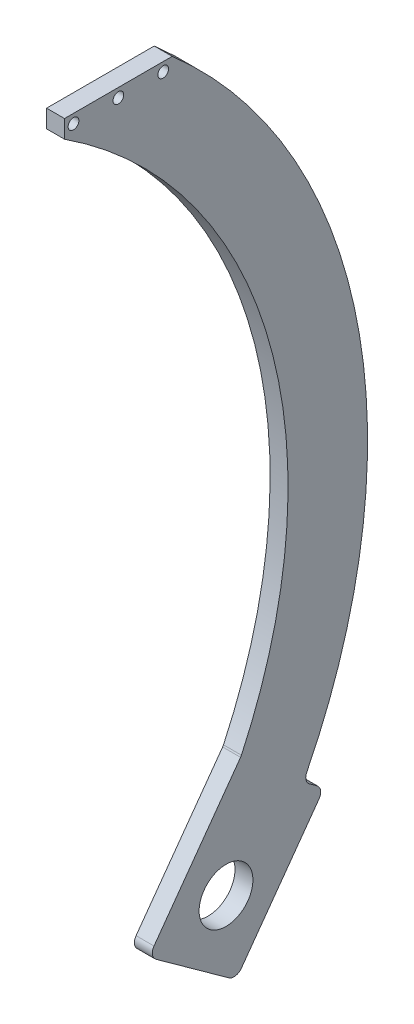
ISO-10303-21;
HEADER;
FILE_DESCRIPTION(('STEP AP214'),'2;1');
FILE_NAME('part.step','',(''),(''),'','','');
FILE_SCHEMA(('AUTOMOTIVE_DESIGN { 1 0 10303 214 1 1 1 1 }'));
ENDSEC;
DATA;
#1=APPLICATION_CONTEXT('core data for automotive mechanical design processes');
#2=APPLICATION_PROTOCOL_DEFINITION('international standard','automotive_design',2000,#1);
#3=PRODUCT_CONTEXT('',#1,'mechanical');
#4=PRODUCT('Part','Part','',(#3));
#5=PRODUCT_RELATED_PRODUCT_CATEGORY('part','',(#4));
#6=PRODUCT_DEFINITION_FORMATION('','',#4);
#7=PRODUCT_DEFINITION_CONTEXT('part definition',#1,'design');
#8=PRODUCT_DEFINITION('design','',#6,#7);
#9=PRODUCT_DEFINITION_SHAPE('','',#8);
#10=(LENGTH_UNIT() NAMED_UNIT(*) SI_UNIT(.MILLI.,.METRE.));
#11=(NAMED_UNIT(*) PLANE_ANGLE_UNIT() SI_UNIT($,.RADIAN.));
#12=(NAMED_UNIT(*) SI_UNIT($,.STERADIAN.) SOLID_ANGLE_UNIT());
#13=UNCERTAINTY_MEASURE_WITH_UNIT(LENGTH_MEASURE(1.E-05),#10,'distance_accuracy_value','');
#14=(GEOMETRIC_REPRESENTATION_CONTEXT(3) GLOBAL_UNCERTAINTY_ASSIGNED_CONTEXT((#13)) GLOBAL_UNIT_ASSIGNED_CONTEXT((#10,
#11,#12)) REPRESENTATION_CONTEXT('',''));
#15=CARTESIAN_POINT('',(0.,0.,0.));
#16=DIRECTION('',(0.,0.,1.));
#17=DIRECTION('',(1.,0.,0.));
#18=AXIS2_PLACEMENT_3D('',#15,#16,#17);
#19=CARTESIAN_POINT('',(6.35,114.3,114.3));
#20=DIRECTION('',(-1.,0.,0.));
#21=DIRECTION('',(0.,0.,1.));
#22=AXIS2_PLACEMENT_3D('',#19,#20,#21);
#23=PLANE('',#22);
#24=DIRECTION('',(0.,0.811253440732448,-0.584694668095892));
#25=VECTOR('',#24,1.);
#26=CARTESIAN_POINT('',(6.35,-27.6231033429099,-41.6733823902444));
#27=LINE('',#26,#25);
#28=CARTESIAN_POINT('',(6.35,-25.0473736685844,-43.5297879614489));
#29=VERTEX_POINT('',#28);
#30=CARTESIAN_POINT('',(6.35,13.073425511438,-71.0045904152782));
#31=VERTEX_POINT('',#30);
#32=EDGE_CURVE('E318',#29,#31,#27,.T.);
#33=ORIENTED_EDGE('',*,*,#32,.T.);
#34=CARTESIAN_POINT('',(6.35,14.9298310826424,-68.4288607409527));
#35=DIRECTION('',(-1.,0.,0.));
#36=DIRECTION('',(0.,0.,1.));
#37=AXIS2_PLACEMENT_3D('',#34,#35,#36);
#38=CIRCLE('',#37,3.175);
#39=CARTESIAN_POINT('',(6.35,17.5055607569679,-70.2852663121571));
#40=VERTEX_POINT('',#39);
#41=EDGE_CURVE('E270',#31,#40,#38,.F.);
#42=ORIENTED_EDGE('',*,*,#41,.T.);
#43=DIRECTION('',(0.,-0.584694668095891,-0.811253440732448));
#44=VECTOR('',#43,1.);
#45=CARTESIAN_POINT('',(6.35,21.0032430671617,-65.4322943875554));
#46=LINE('',#45,#44);
#47=CARTESIAN_POINT('',(6.35,19.4102023335988,-67.6426100392074));
#48=VERTEX_POINT('',#47);
#49=EDGE_CURVE('E311',#48,#40,#46,.T.);
#50=ORIENTED_EDGE('',*,*,#49,.F.);
#51=CARTESIAN_POINT('',(6.35,21.9859320079243,-69.4990156104118));
#52=DIRECTION('',(-1.,0.,0.));
#53=DIRECTION('',(0.,0.,1.));
#54=AXIS2_PLACEMENT_3D('',#51,#52,#53);
#55=CIRCLE('',#54,3.175);
#56=CARTESIAN_POINT('',(6.35,23.4109524042712,-66.6617736626754));
#57=VERTEX_POINT('',#56);
#58=EDGE_CURVE('E12',#48,#57,#55,.T.);
#59=ORIENTED_EDGE('',*,*,#58,.T.);
#60=CARTESIAN_POINT('',(6.35,114.3,114.3));
#61=DIRECTION('',(-1.,0.,0.));
#62=DIRECTION('',(0.,0.,1.));
#63=AXIS2_PLACEMENT_3D('',#60,#61,#62);
#64=CIRCLE('',#63,202.504277732595);
#65=CARTESIAN_POINT('',(6.35,266.7,-19.05));
#66=VERTEX_POINT('',#65);
#67=EDGE_CURVE('E310',#66,#57,#64,.T.);
#68=ORIENTED_EDGE('',*,*,#67,.F.);
#69=DIRECTION('',(0.,0.,-1.));
#70=VECTOR('',#69,1.);
#71=CARTESIAN_POINT('',(6.35,266.7,19.05));
#72=LINE('',#71,#70);
#73=CARTESIAN_POINT('',(6.35,266.7,19.05));
#74=VERTEX_POINT('',#73);
#75=EDGE_CURVE('E212',#74,#66,#72,.T.);
#76=ORIENTED_EDGE('',*,*,#75,.F.);
#77=DIRECTION('',(0.,-1.,0.));
#78=VECTOR('',#77,1.);
#79=CARTESIAN_POINT('',(6.35,266.7,19.05));
#80=LINE('',#79,#78);
#81=CARTESIAN_POINT('',(6.35,260.35,19.05));
#82=VERTEX_POINT('',#81);
#83=EDGE_CURVE('E204',#74,#82,#80,.T.);
#84=ORIENTED_EDGE('',*,*,#83,.T.);
#85=CARTESIAN_POINT('',(6.35,114.3,114.3));
#86=DIRECTION('',(-1.,0.,0.));
#87=DIRECTION('',(0.,0.,1.));
#88=AXIS2_PLACEMENT_3D('',#85,#86,#87);
#89=CIRCLE('',#88,174.365033765374);
#90=CARTESIAN_POINT('',(6.35,40.2506910729311,-43.5602700093456));
#91=VERTEX_POINT('',#90);
#92=EDGE_CURVE('E192',#82,#91,#89,.T.);
#93=ORIENTED_EDGE('',*,*,#92,.T.);
#94=CARTESIAN_POINT('',(6.35,41.5990494608852,-40.6858040315275));
#95=DIRECTION('',(-1.,0.,0.));
#96=DIRECTION('',(0.,0.,1.));
#97=AXIS2_PLACEMENT_3D('',#94,#95,#96);
#98=CIRCLE('',#97,3.175);
#99=CARTESIAN_POINT('',(6.35,39.7426438896807,-43.2615337058531));
#100=VERTEX_POINT('',#99);
#101=EDGE_CURVE('E282',#91,#100,#98,.T.);
#102=ORIENTED_EDGE('',*,*,#101,.T.);
#103=DIRECTION('',(0.,0.811253440732449,-0.58469466809589));
#104=VECTOR('',#103,1.);
#105=CARTESIAN_POINT('',(6.35,37.9260220402172,-41.9522398945765));
#106=LINE('',#105,#104);
#107=CARTESIAN_POINT('',(6.35,-2.77050681413097,-12.6210318695426));
#108=VERTEX_POINT('',#107);
#109=EDGE_CURVE('E203',#108,#100,#106,.T.);
#110=ORIENTED_EDGE('',*,*,#109,.F.);
#111=CARTESIAN_POINT('',(6.35,-4.62691238533537,-15.1967615438681));
#112=DIRECTION('',(-1.,0.,0.));
#113=DIRECTION('',(0.,0.,1.));
#114=AXIS2_PLACEMENT_3D('',#111,#112,#113);
#115=CIRCLE('',#114,3.175);
#116=CARTESIAN_POINT('',(6.35,-7.20264205966089,-13.3403559726636));
#117=VERTEX_POINT('',#116);
#118=EDGE_CURVE('E97',#108,#117,#115,.F.);
#119=ORIENTED_EDGE('',*,*,#118,.T.);
#120=DIRECTION('',(0.,-0.584694668095892,-0.811253440732448));
#121=VECTOR('',#120,1.);
#122=CARTESIAN_POINT('',(6.35,-5.34623648845644,-10.7646262983381));
#123=LINE('',#122,#121);
#124=CARTESIAN_POINT('',(6.35,-25.7666977717055,-39.0976527159189));
#125=VERTEX_POINT('',#124);
#126=EDGE_CURVE('E412',#117,#125,#123,.T.);
#127=ORIENTED_EDGE('',*,*,#126,.T.);
#128=CARTESIAN_POINT('',(6.35,-23.19096809738,-40.9540582871233));
#129=DIRECTION('',(-1.,0.,0.));
#130=DIRECTION('',(0.,0.,1.));
#131=AXIS2_PLACEMENT_3D('',#128,#129,#130);
#132=CIRCLE('',#131,3.175);
#133=EDGE_CURVE('E267',#125,#29,#132,.F.);
#134=ORIENTED_EDGE('',*,*,#133,.T.);
#135=EDGE_LOOP('',(#33,#42,#50,#59,#68,#76,#84,#93,#102,#110,#119,#127,#134));
#136=FACE_BOUND('',#135,.T.);
#137=CARTESIAN_POINT('',(6.35,0.,-38.1));
#138=DIRECTION('',(1.,0.,0.));
#139=DIRECTION('',(0.,0.,-1.));
#140=AXIS2_PLACEMENT_3D('',#137,#138,#139);
#141=CIRCLE('',#140,9.525);
#142=CARTESIAN_POINT('',(6.35,0.,-47.625));
#143=VERTEX_POINT('',#142);
#144=EDGE_CURVE('E325',#143,#143,#141,.T.);
#145=ORIENTED_EDGE('',*,*,#144,.F.);
#146=EDGE_LOOP('',(#145));
#147=FACE_BOUND('',#146,.T.);
#148=CARTESIAN_POINT('',(6.35,263.525,0.));
#149=DIRECTION('',(1.,0.,0.));
#150=DIRECTION('',(0.,0.,-1.));
#151=AXIS2_PLACEMENT_3D('',#148,#149,#150);
#152=CIRCLE('',#151,1.89865);
#153=CARTESIAN_POINT('',(6.35,263.525,-1.89865000000001));
#154=VERTEX_POINT('',#153);
#155=EDGE_CURVE('E396',#154,#154,#152,.T.);
#156=ORIENTED_EDGE('',*,*,#155,.F.);
#157=EDGE_LOOP('',(#156));
#158=FACE_BOUND('',#157,.T.);
#159=CARTESIAN_POINT('',(6.35,263.525,-15.875));
#160=DIRECTION('',(1.,0.,0.));
#161=DIRECTION('',(0.,0.,-1.));
#162=AXIS2_PLACEMENT_3D('',#159,#160,#161);
#163=CIRCLE('',#162,1.89865);
#164=CARTESIAN_POINT('',(6.35,263.525,-17.77365));
#165=VERTEX_POINT('',#164);
#166=EDGE_CURVE('E383',#165,#165,#163,.T.);
#167=ORIENTED_EDGE('',*,*,#166,.F.);
#168=EDGE_LOOP('',(#167));
#169=FACE_BOUND('',#168,.T.);
#170=CARTESIAN_POINT('',(6.35,263.525,15.875));
#171=DIRECTION('',(1.,0.,0.));
#172=DIRECTION('',(0.,0.,-1.));
#173=AXIS2_PLACEMENT_3D('',#170,#171,#172);
#174=CIRCLE('',#173,1.89865);
#175=CARTESIAN_POINT('',(6.35,263.525,13.97635));
#176=VERTEX_POINT('',#175);
#177=EDGE_CURVE('E378',#176,#176,#174,.T.);
#178=ORIENTED_EDGE('',*,*,#177,.F.);
#179=EDGE_LOOP('',(#178));
#180=FACE_BOUND('',#179,.T.);
#181=ADVANCED_FACE('F70',(#136,#147,#158,#169,#180),#23,.F.);
#182=CARTESIAN_POINT('',(0.,114.3,114.3));
#183=DIRECTION('',(-1.,0.,0.));
#184=DIRECTION('',(0.,0.,1.));
#185=AXIS2_PLACEMENT_3D('',#182,#183,#184);
#186=PLANE('',#185);
#187=CARTESIAN_POINT('',(0.,263.525,15.875));
#188=DIRECTION('',(-1.,0.,0.));
#189=DIRECTION('',(0.,0.,1.));
#190=AXIS2_PLACEMENT_3D('',#187,#188,#189);
#191=CIRCLE('',#190,1.89865);
#192=CARTESIAN_POINT('',(0.,263.525,17.77365));
#193=VERTEX_POINT('',#192);
#194=EDGE_CURVE('E381',#193,#193,#191,.T.);
#195=ORIENTED_EDGE('',*,*,#194,.F.);
#196=EDGE_LOOP('',(#195));
#197=FACE_BOUND('',#196,.T.);
#198=CARTESIAN_POINT('',(0.,263.525,-15.875));
#199=DIRECTION('',(-1.,0.,0.));
#200=DIRECTION('',(0.,0.,1.));
#201=AXIS2_PLACEMENT_3D('',#198,#199,#200);
#202=CIRCLE('',#201,1.89865);
#203=CARTESIAN_POINT('',(0.,263.525,-13.97635));
#204=VERTEX_POINT('',#203);
#205=EDGE_CURVE('E389',#204,#204,#202,.T.);
#206=ORIENTED_EDGE('',*,*,#205,.F.);
#207=EDGE_LOOP('',(#206));
#208=FACE_BOUND('',#207,.T.);
#209=CARTESIAN_POINT('',(0.,263.525,0.));
#210=DIRECTION('',(-1.,0.,0.));
#211=DIRECTION('',(0.,0.,1.));
#212=AXIS2_PLACEMENT_3D('',#209,#210,#211);
#213=CIRCLE('',#212,1.89865);
#214=CARTESIAN_POINT('',(0.,263.525,1.89865));
#215=VERTEX_POINT('',#214);
#216=EDGE_CURVE('E399',#215,#215,#213,.T.);
#217=ORIENTED_EDGE('',*,*,#216,.F.);
#218=EDGE_LOOP('',(#217));
#219=FACE_BOUND('',#218,.T.);
#220=DIRECTION('',(0.,-0.584694668095891,-0.811253440732448));
#221=VECTOR('',#220,1.);
#222=CARTESIAN_POINT('',(0.,21.0032430671617,-65.4322943875554));
#223=LINE('',#222,#221);
#224=CARTESIAN_POINT('',(0.,19.4102023335988,-67.6426100392074));
#225=VERTEX_POINT('',#224);
#226=CARTESIAN_POINT('',(0.,17.5055607569679,-70.2852663121571));
#227=VERTEX_POINT('',#226);
#228=EDGE_CURVE('E292',#225,#227,#223,.T.);
#229=ORIENTED_EDGE('',*,*,#228,.T.);
#230=CARTESIAN_POINT('',(0.,14.9298310826424,-68.4288607409527));
#231=DIRECTION('',(-1.,0.,0.));
#232=DIRECTION('',(0.,0.,1.));
#233=AXIS2_PLACEMENT_3D('',#230,#231,#232);
#234=CIRCLE('',#233,3.175);
#235=CARTESIAN_POINT('',(0.,13.073425511438,-71.0045904152782));
#236=VERTEX_POINT('',#235);
#237=EDGE_CURVE('E255',#227,#236,#234,.T.);
#238=ORIENTED_EDGE('',*,*,#237,.T.);
#239=DIRECTION('',(0.,0.811253440732448,-0.584694668095892));
#240=VECTOR('',#239,1.);
#241=CARTESIAN_POINT('',(0.,-27.6231033429099,-41.6733823902444));
#242=LINE('',#241,#240);
#243=CARTESIAN_POINT('',(0.,-25.0473736685844,-43.5297879614489));
#244=VERTEX_POINT('',#243);
#245=EDGE_CURVE('E305',#244,#236,#242,.T.);
#246=ORIENTED_EDGE('',*,*,#245,.F.);
#247=CARTESIAN_POINT('',(0.,-23.19096809738,-40.9540582871233));
#248=DIRECTION('',(-1.,0.,0.));
#249=DIRECTION('',(0.,0.,1.));
#250=AXIS2_PLACEMENT_3D('',#247,#248,#249);
#251=CIRCLE('',#250,3.175);
#252=CARTESIAN_POINT('',(0.,-25.7666977717055,-39.0976527159189));
#253=VERTEX_POINT('',#252);
#254=EDGE_CURVE('E252',#244,#253,#251,.T.);
#255=ORIENTED_EDGE('',*,*,#254,.T.);
#256=DIRECTION('',(0.,-0.584694668095892,-0.811253440732448));
#257=VECTOR('',#256,1.);
#258=CARTESIAN_POINT('',(0.,-5.34623648845644,-10.7646262983381));
#259=LINE('',#258,#257);
#260=CARTESIAN_POINT('',(0.,-7.20264205966089,-13.3403559726636));
#261=VERTEX_POINT('',#260);
#262=EDGE_CURVE('E332',#261,#253,#259,.T.);
#263=ORIENTED_EDGE('',*,*,#262,.F.);
#264=CARTESIAN_POINT('',(0.,-4.62691238533537,-15.1967615438681));
#265=DIRECTION('',(-1.,0.,0.));
#266=DIRECTION('',(0.,0.,1.));
#267=AXIS2_PLACEMENT_3D('',#264,#265,#266);
#268=CIRCLE('',#267,3.175);
#269=CARTESIAN_POINT('',(0.,-2.77050681413092,-12.6210318695426));
#270=VERTEX_POINT('',#269);
#271=EDGE_CURVE('E249',#261,#270,#268,.T.);
#272=ORIENTED_EDGE('',*,*,#271,.T.);
#273=DIRECTION('',(0.,0.811253440732448,-0.584694668095891));
#274=VECTOR('',#273,1.);
#275=CARTESIAN_POINT('',(0.,-5.34623648845644,-10.7646262983381));
#276=LINE('',#275,#274);
#277=CARTESIAN_POINT('',(0.,39.7426438896807,-43.261533705853));
#278=VERTEX_POINT('',#277);
#279=EDGE_CURVE('E328',#270,#278,#276,.T.);
#280=ORIENTED_EDGE('',*,*,#279,.T.);
#281=CARTESIAN_POINT('',(0.,41.5990494608852,-40.6858040315275));
#282=DIRECTION('',(-1.,0.,0.));
#283=DIRECTION('',(0.,0.,1.));
#284=AXIS2_PLACEMENT_3D('',#281,#282,#283);
#285=CIRCLE('',#284,3.175);
#286=CARTESIAN_POINT('',(0.,40.2506910729311,-43.5602700093456));
#287=VERTEX_POINT('',#286);
#288=EDGE_CURVE('E279',#278,#287,#285,.F.);
#289=ORIENTED_EDGE('',*,*,#288,.T.);
#290=CARTESIAN_POINT('',(0.,114.3,114.3));
#291=DIRECTION('',(-1.,0.,0.));
#292=DIRECTION('',(0.,0.,1.));
#293=AXIS2_PLACEMENT_3D('',#290,#291,#292);
#294=CIRCLE('',#293,174.365033765374);
#295=CARTESIAN_POINT('',(0.,260.35,19.05));
#296=VERTEX_POINT('',#295);
#297=EDGE_CURVE('E324',#296,#287,#294,.T.);
#298=ORIENTED_EDGE('',*,*,#297,.F.);
#299=DIRECTION('',(0.,-1.,0.));
#300=VECTOR('',#299,1.);
#301=CARTESIAN_POINT('',(0.,266.7,19.05));
#302=LINE('',#301,#300);
#303=CARTESIAN_POINT('',(0.,266.7,19.05));
#304=VERTEX_POINT('',#303);
#305=EDGE_CURVE('E219',#304,#296,#302,.T.);
#306=ORIENTED_EDGE('',*,*,#305,.F.);
#307=DIRECTION('',(0.,0.,-1.));
#308=VECTOR('',#307,1.);
#309=CARTESIAN_POINT('',(0.,266.7,19.05));
#310=LINE('',#309,#308);
#311=CARTESIAN_POINT('',(0.,266.7,-19.05));
#312=VERTEX_POINT('',#311);
#313=EDGE_CURVE('E215',#304,#312,#310,.T.);
#314=ORIENTED_EDGE('',*,*,#313,.T.);
#315=CARTESIAN_POINT('',(0.,114.3,114.3));
#316=DIRECTION('',(-1.,0.,0.));
#317=DIRECTION('',(0.,0.,1.));
#318=AXIS2_PLACEMENT_3D('',#315,#316,#317);
#319=CIRCLE('',#318,202.504277732595);
#320=CARTESIAN_POINT('',(0.,23.4109524042712,-66.6617736626754));
#321=VERTEX_POINT('',#320);
#322=EDGE_CURVE('E295',#312,#321,#319,.T.);
#323=ORIENTED_EDGE('',*,*,#322,.T.);
#324=CARTESIAN_POINT('',(0.,21.9859320079243,-69.4990156104118));
#325=DIRECTION('',(-1.,0.,0.));
#326=DIRECTION('',(0.,0.,1.));
#327=AXIS2_PLACEMENT_3D('',#324,#325,#326);
#328=CIRCLE('',#327,3.175);
#329=EDGE_CURVE('E79',#321,#225,#328,.F.);
#330=ORIENTED_EDGE('',*,*,#329,.T.);
#331=EDGE_LOOP('',(#229,#238,#246,#255,#263,#272,#280,#289,#298,#306,#314,#323,#330));
#332=FACE_BOUND('',#331,.T.);
#333=CARTESIAN_POINT('',(0.,0.,-38.1));
#334=DIRECTION('',(1.,0.,0.));
#335=DIRECTION('',(0.,0.,-1.));
#336=AXIS2_PLACEMENT_3D('',#333,#334,#335);
#337=CIRCLE('',#336,9.525);
#338=CARTESIAN_POINT('',(0.,0.,-47.625));
#339=VERTEX_POINT('',#338);
#340=EDGE_CURVE('E402',#339,#339,#337,.T.);
#341=ORIENTED_EDGE('',*,*,#340,.T.);
#342=EDGE_LOOP('',(#341));
#343=FACE_BOUND('',#342,.T.);
#344=ADVANCED_FACE('F290',(#197,#208,#219,#332,#343),#186,.T.);
#345=CARTESIAN_POINT('',(6.35,266.7,19.05));
#346=DIRECTION('',(0.,0.,-1.));
#347=DIRECTION('',(0.,1.,0.));
#348=AXIS2_PLACEMENT_3D('',#345,#346,#347);
#349=PLANE('',#348);
#350=ORIENTED_EDGE('',*,*,#305,.T.);
#351=DIRECTION('',(-1.,0.,0.));
#352=VECTOR('',#351,1.);
#353=CARTESIAN_POINT('',(6.35,260.35,19.05));
#354=LINE('',#353,#352);
#355=EDGE_CURVE('E197',#82,#296,#354,.T.);
#356=ORIENTED_EDGE('',*,*,#355,.F.);
#357=ORIENTED_EDGE('',*,*,#83,.F.);
#358=DIRECTION('',(-1.,0.,0.));
#359=VECTOR('',#358,1.);
#360=CARTESIAN_POINT('',(6.35,266.7,19.05));
#361=LINE('',#360,#359);
#362=EDGE_CURVE('E229',#74,#304,#361,.T.);
#363=ORIENTED_EDGE('',*,*,#362,.T.);
#364=EDGE_LOOP('',(#350,#356,#357,#363));
#365=FACE_BOUND('',#364,.T.);
#366=ADVANCED_FACE('F217',(#365),#349,.F.);
#367=CARTESIAN_POINT('',(6.35,114.3,114.3));
#368=DIRECTION('',(-1.,0.,0.));
#369=DIRECTION('',(0.,0.,1.));
#370=AXIS2_PLACEMENT_3D('',#367,#368,#369);
#371=CYLINDRICAL_SURFACE('',#370,174.365033765374);
#372=ORIENTED_EDGE('',*,*,#297,.T.);
#373=DIRECTION('',(-1.,0.,0.));
#374=VECTOR('',#373,1.);
#375=CARTESIAN_POINT('',(6.35,40.2506910729311,-43.5602700093456));
#376=LINE('',#375,#374);
#377=EDGE_CURVE('E200',#287,#91,#376,.F.);
#378=ORIENTED_EDGE('',*,*,#377,.T.);
#379=ORIENTED_EDGE('',*,*,#92,.F.);
#380=ORIENTED_EDGE('',*,*,#355,.T.);
#381=EDGE_LOOP('',(#372,#378,#379,#380));
#382=FACE_BOUND('',#381,.T.);
#383=ADVANCED_FACE('F195',(#382),#371,.F.);
#384=CARTESIAN_POINT('',(6.35,-5.34623648845644,-10.7646262983381));
#385=DIRECTION('',(0.,0.584694668095891,0.811253440732448));
#386=DIRECTION('',(0.,-0.811253440732448,0.584694668095891));
#387=AXIS2_PLACEMENT_3D('',#384,#385,#386);
#388=PLANE('',#387);
#389=ORIENTED_EDGE('',*,*,#109,.T.);
#390=DIRECTION('',(-1.,0.,0.));
#391=VECTOR('',#390,1.);
#392=CARTESIAN_POINT('',(6.35,39.7426438896807,-43.2615337058531));
#393=LINE('',#392,#391);
#394=EDGE_CURVE('E226',#100,#278,#393,.T.);
#395=ORIENTED_EDGE('',*,*,#394,.T.);
#396=ORIENTED_EDGE('',*,*,#279,.F.);
#397=DIRECTION('',(-1.,0.,0.));
#398=VECTOR('',#397,1.);
#399=CARTESIAN_POINT('',(6.35,-2.77050681413092,-12.6210318695426));
#400=LINE('',#399,#398);
#401=EDGE_CURVE('E221',#270,#108,#400,.F.);
#402=ORIENTED_EDGE('',*,*,#401,.T.);
#403=EDGE_LOOP('',(#389,#395,#396,#402));
#404=FACE_BOUND('',#403,.T.);
#405=ADVANCED_FACE('F434',(#404),#388,.T.);
#406=CARTESIAN_POINT('',(6.35,-5.34623648845644,-10.7646262983381));
#407=DIRECTION('',(0.,0.811253440732448,-0.584694668095892));
#408=DIRECTION('',(0.,0.584694668095892,0.811253440732448));
#409=AXIS2_PLACEMENT_3D('',#406,#407,#408);
#410=PLANE('',#409);
#411=ORIENTED_EDGE('',*,*,#262,.T.);
#412=DIRECTION('',(-1.,0.,0.));
#413=VECTOR('',#412,1.);
#414=CARTESIAN_POINT('',(6.35,-25.7666977717055,-39.0976527159189));
#415=LINE('',#414,#413);
#416=EDGE_CURVE('E89',#253,#125,#415,.F.);
#417=ORIENTED_EDGE('',*,*,#416,.T.);
#418=ORIENTED_EDGE('',*,*,#126,.F.);
#419=DIRECTION('',(-1.,0.,0.));
#420=VECTOR('',#419,1.);
#421=CARTESIAN_POINT('',(0.,-7.20264205966089,-13.3403559726636));
#422=LINE('',#421,#420);
#423=EDGE_CURVE('E273',#117,#261,#422,.T.);
#424=ORIENTED_EDGE('',*,*,#423,.T.);
#425=EDGE_LOOP('',(#411,#417,#418,#424));
#426=FACE_BOUND('',#425,.T.);
#427=ADVANCED_FACE('F428',(#426),#410,.F.);
#428=CARTESIAN_POINT('',(6.35,-27.6231033429099,-41.6733823902444));
#429=DIRECTION('',(0.,0.584694668095892,0.811253440732448));
#430=DIRECTION('',(0.,-0.811253440732448,0.584694668095892));
#431=AXIS2_PLACEMENT_3D('',#428,#429,#430);
#432=PLANE('',#431);
#433=ORIENTED_EDGE('',*,*,#245,.T.);
#434=DIRECTION('',(-1.,0.,0.));
#435=VECTOR('',#434,1.);
#436=CARTESIAN_POINT('',(6.35,13.073425511438,-71.0045904152782));
#437=LINE('',#436,#435);
#438=EDGE_CURVE('E262',#236,#31,#437,.F.);
#439=ORIENTED_EDGE('',*,*,#438,.T.);
#440=ORIENTED_EDGE('',*,*,#32,.F.);
#441=DIRECTION('',(-1.,0.,0.));
#442=VECTOR('',#441,1.);
#443=CARTESIAN_POINT('',(6.35,-25.0473736685844,-43.5297879614489));
#444=LINE('',#443,#442);
#445=EDGE_CURVE('E258',#29,#244,#444,.T.);
#446=ORIENTED_EDGE('',*,*,#445,.T.);
#447=EDGE_LOOP('',(#433,#439,#440,#446));
#448=FACE_BOUND('',#447,.T.);
#449=ADVANCED_FACE('F424',(#448),#432,.F.);
#450=CARTESIAN_POINT('',(6.35,21.0032430671617,-65.4322943875554));
#451=DIRECTION('',(0.,0.811253440732448,-0.584694668095891));
#452=DIRECTION('',(0.,0.584694668095891,0.811253440732448));
#453=AXIS2_PLACEMENT_3D('',#450,#451,#452);
#454=PLANE('',#453);
#455=ORIENTED_EDGE('',*,*,#228,.F.);
#456=DIRECTION('',(1.,0.,0.));
#457=VECTOR('',#456,1.);
#458=CARTESIAN_POINT('',(6.35,19.4102023335988,-67.6426100392074));
#459=LINE('',#458,#457);
#460=EDGE_CURVE('E246',#225,#48,#459,.T.);
#461=ORIENTED_EDGE('',*,*,#460,.T.);
#462=ORIENTED_EDGE('',*,*,#49,.T.);
#463=DIRECTION('',(-1.,0.,0.));
#464=VECTOR('',#463,1.);
#465=CARTESIAN_POINT('',(0.,17.5055607569679,-70.2852663121571));
#466=LINE('',#465,#464);
#467=EDGE_CURVE('E242',#40,#227,#466,.T.);
#468=ORIENTED_EDGE('',*,*,#467,.T.);
#469=EDGE_LOOP('',(#455,#461,#462,#468));
#470=FACE_BOUND('',#469,.T.);
#471=ADVANCED_FACE('F300',(#470),#454,.T.);
#472=CARTESIAN_POINT('',(6.35,114.3,114.3));
#473=DIRECTION('',(-1.,0.,0.));
#474=DIRECTION('',(0.,0.,1.));
#475=AXIS2_PLACEMENT_3D('',#472,#473,#474);
#476=CYLINDRICAL_SURFACE('',#475,202.504277732595);
#477=ORIENTED_EDGE('',*,*,#67,.T.);
#478=DIRECTION('',(-1.,0.,0.));
#479=VECTOR('',#478,1.);
#480=CARTESIAN_POINT('',(6.35,23.4109524042712,-66.6617736626754));
#481=LINE('',#480,#479);
#482=EDGE_CURVE('E238',#57,#321,#481,.T.);
#483=ORIENTED_EDGE('',*,*,#482,.T.);
#484=ORIENTED_EDGE('',*,*,#322,.F.);
#485=DIRECTION('',(-1.,0.,0.));
#486=VECTOR('',#485,1.);
#487=CARTESIAN_POINT('',(6.35,266.7,-19.05));
#488=LINE('',#487,#486);
#489=EDGE_CURVE('E222',#66,#312,#488,.T.);
#490=ORIENTED_EDGE('',*,*,#489,.F.);
#491=EDGE_LOOP('',(#477,#483,#484,#490));
#492=FACE_BOUND('',#491,.T.);
#493=ADVANCED_FACE('F313',(#492),#476,.T.);
#494=CARTESIAN_POINT('',(6.35,266.7,19.05));
#495=DIRECTION('',(0.,1.,0.));
#496=DIRECTION('',(0.,0.,1.));
#497=AXIS2_PLACEMENT_3D('',#494,#495,#496);
#498=PLANE('',#497);
#499=ORIENTED_EDGE('',*,*,#313,.F.);
#500=ORIENTED_EDGE('',*,*,#362,.F.);
#501=ORIENTED_EDGE('',*,*,#75,.T.);
#502=ORIENTED_EDGE('',*,*,#489,.T.);
#503=EDGE_LOOP('',(#499,#500,#501,#502));
#504=FACE_BOUND('',#503,.T.);
#505=ADVANCED_FACE('F342',(#504),#498,.T.);
#506=CARTESIAN_POINT('',(6.35,0.,-38.1));
#507=DIRECTION('',(-1.,0.,0.));
#508=DIRECTION('',(0.,0.,1.));
#509=AXIS2_PLACEMENT_3D('',#506,#507,#508);
#510=CYLINDRICAL_SURFACE('',#509,9.525);
#511=ORIENTED_EDGE('',*,*,#144,.T.);
#512=EDGE_LOOP('',(#511));
#513=FACE_BOUND('',#512,.T.);
#514=ORIENTED_EDGE('',*,*,#340,.F.);
#515=EDGE_LOOP('',(#514));
#516=FACE_BOUND('',#515,.T.);
#517=ADVANCED_FACE('F344',(#513,#516),#510,.F.);
#518=CARTESIAN_POINT('',(6.35,41.5990494608852,-40.6858040315275));
#519=DIRECTION('',(-1.,0.,0.));
#520=DIRECTION('',(0.,0.,1.));
#521=AXIS2_PLACEMENT_3D('',#518,#519,#520);
#522=CYLINDRICAL_SURFACE('',#521,3.175);
#523=ORIENTED_EDGE('',*,*,#101,.F.);
#524=ORIENTED_EDGE('',*,*,#377,.F.);
#525=ORIENTED_EDGE('',*,*,#288,.F.);
#526=ORIENTED_EDGE('',*,*,#394,.F.);
#527=EDGE_LOOP('',(#523,#524,#525,#526));
#528=FACE_BOUND('',#527,.T.);
#529=ADVANCED_FACE('F350',(#528),#522,.F.);
#530=CARTESIAN_POINT('',(6.35,21.9859320079243,-69.4990156104118));
#531=DIRECTION('',(-1.,0.,0.));
#532=DIRECTION('',(0.,0.,1.));
#533=AXIS2_PLACEMENT_3D('',#530,#531,#532);
#534=CYLINDRICAL_SURFACE('',#533,3.175);
#535=ORIENTED_EDGE('',*,*,#58,.F.);
#536=ORIENTED_EDGE('',*,*,#460,.F.);
#537=ORIENTED_EDGE('',*,*,#329,.F.);
#538=ORIENTED_EDGE('',*,*,#482,.F.);
#539=EDGE_LOOP('',(#535,#536,#537,#538));
#540=FACE_BOUND('',#539,.T.);
#541=ADVANCED_FACE('F308',(#540),#534,.F.);
#542=CARTESIAN_POINT('',(6.35,14.9298310826424,-68.4288607409527));
#543=DIRECTION('',(1.,0.,0.));
#544=DIRECTION('',(0.,0.,-1.));
#545=AXIS2_PLACEMENT_3D('',#542,#543,#544);
#546=CYLINDRICAL_SURFACE('',#545,3.175);
#547=ORIENTED_EDGE('',*,*,#41,.F.);
#548=ORIENTED_EDGE('',*,*,#438,.F.);
#549=ORIENTED_EDGE('',*,*,#237,.F.);
#550=ORIENTED_EDGE('',*,*,#467,.F.);
#551=EDGE_LOOP('',(#547,#548,#549,#550));
#552=FACE_BOUND('',#551,.T.);
#553=ADVANCED_FACE('F422',(#552),#546,.T.);
#554=CARTESIAN_POINT('',(6.35,-23.19096809738,-40.9540582871233));
#555=DIRECTION('',(-1.,0.,0.));
#556=DIRECTION('',(0.,0.,1.));
#557=AXIS2_PLACEMENT_3D('',#554,#555,#556);
#558=CYLINDRICAL_SURFACE('',#557,3.175);
#559=ORIENTED_EDGE('',*,*,#133,.F.);
#560=ORIENTED_EDGE('',*,*,#416,.F.);
#561=ORIENTED_EDGE('',*,*,#254,.F.);
#562=ORIENTED_EDGE('',*,*,#445,.F.);
#563=EDGE_LOOP('',(#559,#560,#561,#562));
#564=FACE_BOUND('',#563,.T.);
#565=ADVANCED_FACE('F426',(#564),#558,.T.);
#566=CARTESIAN_POINT('',(6.35,-4.62691238533537,-15.1967615438681));
#567=DIRECTION('',(1.,0.,0.));
#568=DIRECTION('',(0.,0.,-1.));
#569=AXIS2_PLACEMENT_3D('',#566,#567,#568);
#570=CYLINDRICAL_SURFACE('',#569,3.175);
#571=ORIENTED_EDGE('',*,*,#118,.F.);
#572=ORIENTED_EDGE('',*,*,#401,.F.);
#573=ORIENTED_EDGE('',*,*,#271,.F.);
#574=ORIENTED_EDGE('',*,*,#423,.F.);
#575=EDGE_LOOP('',(#571,#572,#573,#574));
#576=FACE_BOUND('',#575,.T.);
#577=ADVANCED_FACE('F72',(#576),#570,.T.);
#578=CARTESIAN_POINT('',(6.35,263.525,0.));
#579=DIRECTION('',(1.,0.,0.));
#580=DIRECTION('',(0.,0.,-1.));
#581=AXIS2_PLACEMENT_3D('',#578,#579,#580);
#582=CYLINDRICAL_SURFACE('',#581,1.89865);
#583=ORIENTED_EDGE('',*,*,#155,.T.);
#584=EDGE_LOOP('',(#583));
#585=FACE_BOUND('',#584,.T.);
#586=ORIENTED_EDGE('',*,*,#216,.T.);
#587=EDGE_LOOP('',(#586));
#588=FACE_BOUND('',#587,.T.);
#589=ADVANCED_FACE('F362',(#585,#588),#582,.F.);
#590=CARTESIAN_POINT('',(6.35,263.525,-15.875));
#591=DIRECTION('',(1.,0.,0.));
#592=DIRECTION('',(0.,0.,-1.));
#593=AXIS2_PLACEMENT_3D('',#590,#591,#592);
#594=CYLINDRICAL_SURFACE('',#593,1.89865);
#595=ORIENTED_EDGE('',*,*,#166,.T.);
#596=EDGE_LOOP('',(#595));
#597=FACE_BOUND('',#596,.T.);
#598=ORIENTED_EDGE('',*,*,#205,.T.);
#599=EDGE_LOOP('',(#598));
#600=FACE_BOUND('',#599,.T.);
#601=ADVANCED_FACE('F365',(#597,#600),#594,.F.);
#602=CARTESIAN_POINT('',(6.35,263.525,15.875));
#603=DIRECTION('',(1.,0.,0.));
#604=DIRECTION('',(0.,0.,-1.));
#605=AXIS2_PLACEMENT_3D('',#602,#603,#604);
#606=CYLINDRICAL_SURFACE('',#605,1.89865);
#607=ORIENTED_EDGE('',*,*,#177,.T.);
#608=EDGE_LOOP('',(#607));
#609=FACE_BOUND('',#608,.T.);
#610=ORIENTED_EDGE('',*,*,#194,.T.);
#611=EDGE_LOOP('',(#610));
#612=FACE_BOUND('',#611,.T.);
#613=ADVANCED_FACE('F369',(#609,#612),#606,.F.);
#614=CLOSED_SHELL('',(#181,#344,#366,#383,#405,#427,#449,#471,#493,#505,#517,#529,#541,#553,
#565,#577,#589,#601,#613));
#615=MANIFOLD_SOLID_BREP('B2',#614);
#616=ADVANCED_BREP_SHAPE_REPRESENTATION('',(#18,#615),#14);
#617=SHAPE_DEFINITION_REPRESENTATION(#9,#616);
ENDSEC;
END-ISO-10303-21;
